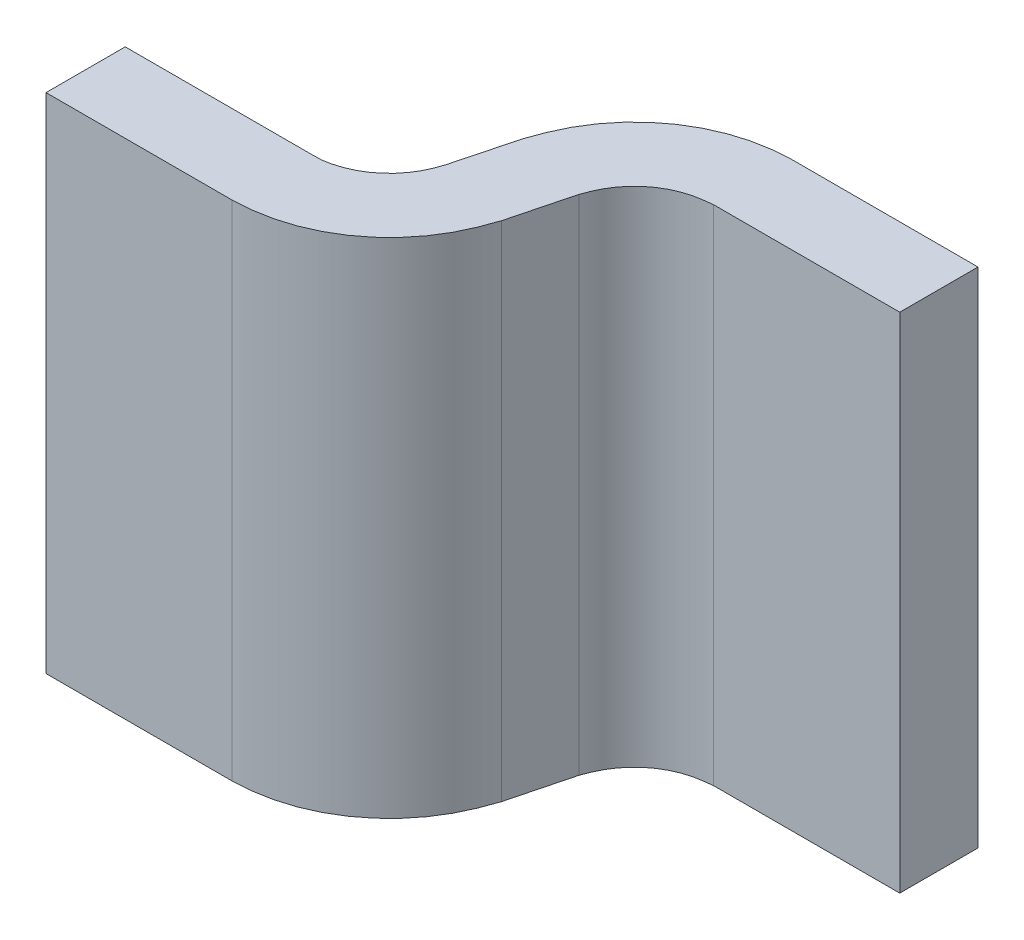
ISO-10303-21;
HEADER;
FILE_DESCRIPTION(('STEP AP214'),'2;1');
FILE_NAME('part.step','',(''),(''),'','','');
FILE_SCHEMA(('AUTOMOTIVE_DESIGN { 1 0 10303 214 1 1 1 1 }'));
ENDSEC;
DATA;
#1=APPLICATION_CONTEXT('core data for automotive mechanical design processes');
#2=APPLICATION_PROTOCOL_DEFINITION('international standard','automotive_design',2000,#1);
#3=PRODUCT_CONTEXT('',#1,'mechanical');
#4=PRODUCT('Part','Part','',(#3));
#5=PRODUCT_RELATED_PRODUCT_CATEGORY('part','',(#4));
#6=PRODUCT_DEFINITION_FORMATION('','',#4);
#7=PRODUCT_DEFINITION_CONTEXT('part definition',#1,'design');
#8=PRODUCT_DEFINITION('design','',#6,#7);
#9=PRODUCT_DEFINITION_SHAPE('','',#8);
#10=(LENGTH_UNIT() NAMED_UNIT(*) SI_UNIT(.MILLI.,.METRE.));
#11=(NAMED_UNIT(*) PLANE_ANGLE_UNIT() SI_UNIT($,.RADIAN.));
#12=(NAMED_UNIT(*) SI_UNIT($,.STERADIAN.) SOLID_ANGLE_UNIT());
#13=UNCERTAINTY_MEASURE_WITH_UNIT(LENGTH_MEASURE(1.E-05),#10,'distance_accuracy_value','');
#14=(GEOMETRIC_REPRESENTATION_CONTEXT(3) GLOBAL_UNCERTAINTY_ASSIGNED_CONTEXT((#13)) GLOBAL_UNIT_ASSIGNED_CONTEXT((#10,
#11,#12)) REPRESENTATION_CONTEXT('',''));
#15=CARTESIAN_POINT('',(0.,0.,0.));
#16=DIRECTION('',(0.,0.,1.));
#17=DIRECTION('',(1.,0.,0.));
#18=AXIS2_PLACEMENT_3D('',#15,#16,#17);
#19=CARTESIAN_POINT('',(0.876,1.204,0.238));
#20=DIRECTION('',(-1.,0.,0.));
#21=DIRECTION('',(0.,0.,1.));
#22=AXIS2_PLACEMENT_3D('',#19,#20,#21);
#23=PLANE('',#22);
#24=DIRECTION('',(0.,1.,0.));
#25=VECTOR('',#24,1.);
#26=CARTESIAN_POINT('',(0.876,0.696,0.238));
#27=LINE('',#26,#25);
#28=CARTESIAN_POINT('',(0.876,0.696,0.238));
#29=VERTEX_POINT('',#28);
#30=CARTESIAN_POINT('',(0.876,1.204,0.238));
#31=VERTEX_POINT('',#30);
#32=EDGE_CURVE('E11',#29,#31,#27,.T.);
#33=ORIENTED_EDGE('',*,*,#32,.F.);
#34=DIRECTION('',(0.,0.,-1.));
#35=VECTOR('',#34,1.);
#36=CARTESIAN_POINT('',(0.876,0.696,0.318));
#37=LINE('',#36,#35);
#38=CARTESIAN_POINT('',(0.876,0.696,0.318));
#39=VERTEX_POINT('',#38);
#40=EDGE_CURVE('E24',#39,#29,#37,.T.);
#41=ORIENTED_EDGE('',*,*,#40,.F.);
#42=DIRECTION('',(0.,-1.,0.));
#43=VECTOR('',#42,1.);
#44=CARTESIAN_POINT('',(0.876,1.204,0.318));
#45=LINE('',#44,#43);
#46=CARTESIAN_POINT('',(0.876,1.204,0.318));
#47=VERTEX_POINT('',#46);
#48=EDGE_CURVE('E439',#47,#39,#45,.T.);
#49=ORIENTED_EDGE('',*,*,#48,.F.);
#50=DIRECTION('',(0.,0.,1.));
#51=VECTOR('',#50,1.);
#52=CARTESIAN_POINT('',(0.876,1.204,0.238));
#53=LINE('',#52,#51);
#54=EDGE_CURVE('E437',#31,#47,#53,.T.);
#55=ORIENTED_EDGE('',*,*,#54,.F.);
#56=EDGE_LOOP('',(#33,#41,#49,#55));
#57=FACE_BOUND('',#56,.T.);
#58=ADVANCED_FACE('F17',(#57),#23,.T.);
#59=CARTESIAN_POINT('',(0.876,1.204,0.318));
#60=DIRECTION('',(0.,0.,1.));
#61=DIRECTION('',(0.,1.,0.));
#62=AXIS2_PLACEMENT_3D('',#59,#60,#61);
#63=PLANE('',#62);
#64=ORIENTED_EDGE('',*,*,#48,.T.);
#65=DIRECTION('',(-1.,0.,0.));
#66=VECTOR('',#65,1.);
#67=CARTESIAN_POINT('',(1.064,0.696,0.318));
#68=LINE('',#67,#66);
#69=CARTESIAN_POINT('',(1.064,0.696,0.318));
#70=VERTEX_POINT('',#69);
#71=EDGE_CURVE('E435',#70,#39,#68,.T.);
#72=ORIENTED_EDGE('',*,*,#71,.F.);
#73=CARTESIAN_POINT('',(1.064,1.204,0.31775));
#74=DIRECTION('',(0.,-1.,0.));
#75=VECTOR('',#74,1.);
#76=LINE('',#73,#75);
#77=CARTESIAN_POINT('',(1.064,1.204,0.318));
#78=VERTEX_POINT('',#77);
#79=EDGE_CURVE('E257',#78,#70,#76,.T.);
#80=ORIENTED_EDGE('',*,*,#79,.F.);
#81=DIRECTION('',(1.,0.,0.));
#82=VECTOR('',#81,1.);
#83=CARTESIAN_POINT('',(0.876,1.204,0.318));
#84=LINE('',#83,#82);
#85=EDGE_CURVE('E247',#47,#78,#84,.T.);
#86=ORIENTED_EDGE('',*,*,#85,.F.);
#87=EDGE_LOOP('',(#64,#72,#80,#86));
#88=FACE_BOUND('',#87,.T.);
#89=ADVANCED_FACE('F237',(#88),#63,.T.);
#90=CARTESIAN_POINT('',(0.876,0.696,0.238));
#91=DIRECTION('',(0.,0.,-1.));
#92=DIRECTION('',(0.,1.,0.));
#93=AXIS2_PLACEMENT_3D('',#90,#91,#92);
#94=PLANE('',#93);
#95=ORIENTED_EDGE('',*,*,#32,.T.);
#96=DIRECTION('',(-1.,0.,0.));
#97=VECTOR('',#96,1.);
#98=CARTESIAN_POINT('',(1.064,1.204,0.238));
#99=LINE('',#98,#97);
#100=CARTESIAN_POINT('',(1.064,1.204,0.238));
#101=VERTEX_POINT('',#100);
#102=EDGE_CURVE('E443',#101,#31,#99,.T.);
#103=ORIENTED_EDGE('',*,*,#102,.F.);
#104=CARTESIAN_POINT('',(1.064,0.696,0.238375));
#105=DIRECTION('',(0.,1.,0.));
#106=VECTOR('',#105,1.);
#107=LINE('',#104,#106);
#108=CARTESIAN_POINT('',(1.064,0.696,0.238));
#109=VERTEX_POINT('',#108);
#110=EDGE_CURVE('E222',#109,#101,#107,.T.);
#111=ORIENTED_EDGE('',*,*,#110,.F.);
#112=DIRECTION('',(1.,0.,0.));
#113=VECTOR('',#112,1.);
#114=CARTESIAN_POINT('',(0.876,0.696,0.238));
#115=LINE('',#114,#113);
#116=EDGE_CURVE('E219',#29,#109,#115,.T.);
#117=ORIENTED_EDGE('',*,*,#116,.F.);
#118=EDGE_LOOP('',(#95,#103,#111,#117));
#119=FACE_BOUND('',#118,.T.);
#120=ADVANCED_FACE('F228',(#119),#94,.T.);
#121=CARTESIAN_POINT('',(1.234,0.696,0.138));
#122=DIRECTION('',(0.965885549343203,0.,0.258969313954337));
#123=DIRECTION('',(-0.258969313954337,0.,0.965885549343203));
#124=AXIS2_PLACEMENT_3D('',#121,#122,#123);
#125=PLANE('',#124);
#126=CARTESIAN_POINT('',(1.23442187168926,1.204,0.138115055915251));
#127=DIRECTION('',(0.,-1.,0.));
#128=VECTOR('',#127,1.);
#129=LINE('',#126,#128);
#130=CARTESIAN_POINT('',(1.234,1.204,0.138));
#131=VERTEX_POINT('',#130);
#132=CARTESIAN_POINT('',(1.234,0.696,0.138));
#133=VERTEX_POINT('',#132);
#134=EDGE_CURVE('E215',#131,#133,#129,.T.);
#135=ORIENTED_EDGE('',*,*,#134,.F.);
#136=CARTESIAN_POINT('',(1.218,1.204,0.2));
#137=DIRECTION('',(0.258969313954338,0.,-0.965885549343202));
#138=VECTOR('',#137,1.);
#139=LINE('',#136,#138);
#140=CARTESIAN_POINT('',(1.218,1.204,0.2));
#141=VERTEX_POINT('',#140);
#142=EDGE_CURVE('E301',#141,#131,#139,.T.);
#143=ORIENTED_EDGE('',*,*,#142,.F.);
#144=CARTESIAN_POINT('',(1.21740631765688,0.696,0.199841941713844));
#145=DIRECTION('',(0.,1.,0.));
#146=VECTOR('',#145,1.);
#147=LINE('',#144,#146);
#148=CARTESIAN_POINT('',(1.218,0.696,0.2));
#149=VERTEX_POINT('',#148);
#150=EDGE_CURVE('E288',#149,#141,#147,.T.);
#151=ORIENTED_EDGE('',*,*,#150,.F.);
#152=DIRECTION('',(-0.258969313954337,0.,0.965885549343202));
#153=VECTOR('',#152,1.);
#154=CARTESIAN_POINT('',(1.234,0.696,0.138));
#155=LINE('',#154,#153);
#156=EDGE_CURVE('E356',#133,#149,#155,.T.);
#157=ORIENTED_EDGE('',*,*,#156,.F.);
#158=EDGE_LOOP('',(#135,#143,#151,#157));
#159=FACE_BOUND('',#158,.T.);
#160=ADVANCED_FACE('F236',(#159),#125,.T.);
#161=CARTESIAN_POINT('',(1.157,1.204,0.118));
#162=DIRECTION('',(-0.965885549343203,0.,-0.258969313954337));
#163=DIRECTION('',(-0.258969313954337,0.,0.965885549343203));
#164=AXIS2_PLACEMENT_3D('',#161,#162,#163);
#165=PLANE('',#164);
#166=CARTESIAN_POINT('',(1.15759368234312,0.696,0.118158058286156));
#167=DIRECTION('',(0.,1.,0.));
#168=VECTOR('',#167,1.);
#169=LINE('',#166,#168);
#170=CARTESIAN_POINT('',(1.157,0.696,0.118));
#171=VERTEX_POINT('',#170);
#172=CARTESIAN_POINT('',(1.157,1.204,0.118));
#173=VERTEX_POINT('',#172);
#174=EDGE_CURVE('E342',#171,#173,#169,.T.);
#175=ORIENTED_EDGE('',*,*,#174,.F.);
#176=CARTESIAN_POINT('',(1.141,0.696,0.179));
#177=DIRECTION('',(0.258969313954335,0.,-0.965885549343203));
#178=VECTOR('',#177,1.);
#179=LINE('',#176,#178);
#180=CARTESIAN_POINT('',(1.141,0.696,0.179));
#181=VERTEX_POINT('',#180);
#182=EDGE_CURVE('E330',#181,#171,#179,.T.);
#183=ORIENTED_EDGE('',*,*,#182,.F.);
#184=CARTESIAN_POINT('',(1.14082576891933,1.204,0.178954745173853));
#185=DIRECTION('',(0.,-1.,0.));
#186=VECTOR('',#185,1.);
#187=LINE('',#184,#186);
#188=CARTESIAN_POINT('',(1.141,1.204,0.179));
#189=VERTEX_POINT('',#188);
#190=EDGE_CURVE('E366',#189,#181,#187,.T.);
#191=ORIENTED_EDGE('',*,*,#190,.F.);
#192=DIRECTION('',(-0.258969313954337,0.,0.965885549343203));
#193=VECTOR('',#192,1.);
#194=CARTESIAN_POINT('',(1.157,1.204,0.118));
#195=LINE('',#194,#193);
#196=EDGE_CURVE('E368',#173,#189,#195,.T.);
#197=ORIENTED_EDGE('',*,*,#196,.F.);
#198=EDGE_LOOP('',(#175,#183,#191,#197));
#199=FACE_BOUND('',#198,.T.);
#200=ADVANCED_FACE('F160',(#199),#165,.T.);
#201=CARTESIAN_POINT('',(1.499,0.696,0.079));
#202=DIRECTION('',(0.,0.,1.));
#203=DIRECTION('',(0.,1.,0.));
#204=AXIS2_PLACEMENT_3D('',#201,#202,#203);
#205=PLANE('',#204);
#206=DIRECTION('',(0.,-1.,0.));
#207=VECTOR('',#206,1.);
#208=CARTESIAN_POINT('',(1.499,1.204,0.079));
#209=LINE('',#208,#207);
#210=CARTESIAN_POINT('',(1.499,1.204,0.079));
#211=VERTEX_POINT('',#210);
#212=CARTESIAN_POINT('',(1.499,0.696,0.079));
#213=VERTEX_POINT('',#212);
#214=EDGE_CURVE('E125',#211,#213,#209,.T.);
#215=ORIENTED_EDGE('',*,*,#214,.F.);
#216=DIRECTION('',(1.,0.,0.));
#217=VECTOR('',#216,1.);
#218=CARTESIAN_POINT('',(1.311,1.204,0.079));
#219=LINE('',#218,#217);
#220=CARTESIAN_POINT('',(1.311,1.204,0.079));
#221=VERTEX_POINT('',#220);
#222=EDGE_CURVE('E377',#221,#211,#219,.T.);
#223=ORIENTED_EDGE('',*,*,#222,.F.);
#224=CARTESIAN_POINT('',(1.311,0.696,0.079625));
#225=DIRECTION('',(0.,1.,0.));
#226=VECTOR('',#225,1.);
#227=LINE('',#224,#226);
#228=CARTESIAN_POINT('',(1.311,0.696,0.079));
#229=VERTEX_POINT('',#228);
#230=EDGE_CURVE('E178',#229,#221,#227,.T.);
#231=ORIENTED_EDGE('',*,*,#230,.F.);
#232=DIRECTION('',(-1.,0.,0.));
#233=VECTOR('',#232,1.);
#234=CARTESIAN_POINT('',(1.499,0.696,0.079));
#235=LINE('',#234,#233);
#236=EDGE_CURVE('E169',#213,#229,#235,.T.);
#237=ORIENTED_EDGE('',*,*,#236,.F.);
#238=EDGE_LOOP('',(#215,#223,#231,#237));
#239=FACE_BOUND('',#238,.T.);
#240=ADVANCED_FACE('F155',(#239),#205,.T.);
#241=CARTESIAN_POINT('',(1.311,0.696,0.));
#242=DIRECTION('',(0.,0.,-1.));
#243=DIRECTION('',(0.,1.,0.));
#244=AXIS2_PLACEMENT_3D('',#241,#242,#243);
#245=PLANE('',#244);
#246=CARTESIAN_POINT('',(1.311,1.204,0.000249999999999979));
#247=DIRECTION('',(0.,-1.,0.));
#248=VECTOR('',#247,1.);
#249=LINE('',#246,#248);
#250=CARTESIAN_POINT('',(1.311,1.204,0.));
#251=VERTEX_POINT('',#250);
#252=CARTESIAN_POINT('',(1.311,0.696,0.));
#253=VERTEX_POINT('',#252);
#254=EDGE_CURVE('E140',#251,#253,#249,.T.);
#255=ORIENTED_EDGE('',*,*,#254,.F.);
#256=DIRECTION('',(-1.,0.,0.));
#257=VECTOR('',#256,1.);
#258=CARTESIAN_POINT('',(1.499,1.204,0.));
#259=LINE('',#258,#257);
#260=CARTESIAN_POINT('',(1.499,1.204,0.));
#261=VERTEX_POINT('',#260);
#262=EDGE_CURVE('E107',#261,#251,#259,.T.);
#263=ORIENTED_EDGE('',*,*,#262,.F.);
#264=DIRECTION('',(0.,1.,0.));
#265=VECTOR('',#264,1.);
#266=CARTESIAN_POINT('',(1.499,0.696,0.));
#267=LINE('',#266,#265);
#268=CARTESIAN_POINT('',(1.499,0.696,0.));
#269=VERTEX_POINT('',#268);
#270=EDGE_CURVE('E101',#269,#261,#267,.T.);
#271=ORIENTED_EDGE('',*,*,#270,.F.);
#272=DIRECTION('',(1.,0.,0.));
#273=VECTOR('',#272,1.);
#274=CARTESIAN_POINT('',(1.311,0.696,0.));
#275=LINE('',#274,#273);
#276=EDGE_CURVE('E104',#253,#269,#275,.T.);
#277=ORIENTED_EDGE('',*,*,#276,.F.);
#278=EDGE_LOOP('',(#255,#263,#271,#277));
#279=FACE_BOUND('',#278,.T.);
#280=ADVANCED_FACE('F103',(#279),#245,.T.);
#281=CARTESIAN_POINT('',(1.499,0.696,0.));
#282=DIRECTION('',(1.,0.,0.));
#283=DIRECTION('',(0.,0.,1.));
#284=AXIS2_PLACEMENT_3D('',#281,#282,#283);
#285=PLANE('',#284);
#286=ORIENTED_EDGE('',*,*,#270,.T.);
#287=DIRECTION('',(0.,0.,-1.));
#288=VECTOR('',#287,1.);
#289=CARTESIAN_POINT('',(1.499,1.204,0.079));
#290=LINE('',#289,#288);
#291=EDGE_CURVE('E122',#211,#261,#290,.T.);
#292=ORIENTED_EDGE('',*,*,#291,.F.);
#293=ORIENTED_EDGE('',*,*,#214,.T.);
#294=DIRECTION('',(0.,0.,1.));
#295=VECTOR('',#294,1.);
#296=CARTESIAN_POINT('',(1.499,0.696,0.));
#297=LINE('',#296,#295);
#298=EDGE_CURVE('E118',#269,#213,#297,.T.);
#299=ORIENTED_EDGE('',*,*,#298,.F.);
#300=EDGE_LOOP('',(#286,#292,#293,#299));
#301=FACE_BOUND('',#300,.T.);
#302=ADVANCED_FACE('F124',(#301),#285,.T.);
#303=CARTESIAN_POINT('',(1.064,1.204,0.159));
#304=DIRECTION('',(0.,1.,0.));
#305=DIRECTION('',(0.,0.,1.));
#306=AXIS2_PLACEMENT_3D('',#303,#304,#305);
#307=CYLINDRICAL_SURFACE('',#306,0.15875);
#308=ORIENTED_EDGE('',*,*,#79,.T.);
#309=CARTESIAN_POINT('',(1.064,0.696,0.159));
#310=DIRECTION('',(0.,-1.,0.));
#311=DIRECTION('',(-0.793107076683516,0.,0.609082231652284));
#312=AXIS2_PLACEMENT_3D('',#309,#310,#311);
#313=CIRCLE('',#312,0.15875);
#314=EDGE_CURVE('E127',#149,#70,#313,.T.);
#315=ORIENTED_EDGE('',*,*,#314,.F.);
#316=ORIENTED_EDGE('',*,*,#150,.T.);
#317=CARTESIAN_POINT('',(1.064,1.204,0.159));
#318=DIRECTION('',(0.,1.,0.));
#319=DIRECTION('',(0.793107076683516,0.,-0.609082231652284));
#320=AXIS2_PLACEMENT_3D('',#317,#318,#319);
#321=CIRCLE('',#320,0.15875);
#322=EDGE_CURVE('E131',#78,#141,#321,.T.);
#323=ORIENTED_EDGE('',*,*,#322,.F.);
#324=EDGE_LOOP('',(#308,#315,#316,#323));
#325=FACE_BOUND('',#324,.T.);
#326=ADVANCED_FACE('F263',(#325),#307,.T.);
#327=CARTESIAN_POINT('',(1.064,0.696,0.159));
#328=DIRECTION('',(0.,1.,0.));
#329=DIRECTION('',(0.,0.,-1.));
#330=AXIS2_PLACEMENT_3D('',#327,#328,#329);
#331=CYLINDRICAL_SURFACE('',#330,0.079375);
#332=ORIENTED_EDGE('',*,*,#110,.T.);
#333=CARTESIAN_POINT('',(1.064,1.204,0.159));
#334=DIRECTION('',(0.,-1.,0.));
#335=DIRECTION('',(-0.793107076683516,0.,0.609082231652284));
#336=AXIS2_PLACEMENT_3D('',#333,#334,#335);
#337=CIRCLE('',#336,0.079375);
#338=EDGE_CURVE('E427',#189,#101,#337,.T.);
#339=ORIENTED_EDGE('',*,*,#338,.F.);
#340=ORIENTED_EDGE('',*,*,#190,.T.);
#341=CARTESIAN_POINT('',(1.064,0.696,0.159));
#342=DIRECTION('',(0.,1.,0.));
#343=DIRECTION('',(0.793107076683516,0.,-0.609082231652284));
#344=AXIS2_PLACEMENT_3D('',#341,#342,#343);
#345=CIRCLE('',#344,0.079375);
#346=EDGE_CURVE('E423',#109,#181,#345,.T.);
#347=ORIENTED_EDGE('',*,*,#346,.F.);
#348=EDGE_LOOP('',(#332,#339,#340,#347));
#349=FACE_BOUND('',#348,.T.);
#350=ADVANCED_FACE('F195',(#349),#331,.F.);
#351=CARTESIAN_POINT('',(1.311,0.696,0.159));
#352=DIRECTION('',(0.,1.,0.));
#353=DIRECTION('',(0.,0.,1.));
#354=AXIS2_PLACEMENT_3D('',#351,#352,#353);
#355=CYLINDRICAL_SURFACE('',#354,0.079375);
#356=ORIENTED_EDGE('',*,*,#230,.T.);
#357=CARTESIAN_POINT('',(1.311,1.204,0.159));
#358=DIRECTION('',(0.,-1.,0.));
#359=DIRECTION('',(0.793107076683516,0.,-0.609082231652284));
#360=AXIS2_PLACEMENT_3D('',#357,#358,#359);
#361=CIRCLE('',#360,0.079375);
#362=EDGE_CURVE('E418',#131,#221,#361,.T.);
#363=ORIENTED_EDGE('',*,*,#362,.F.);
#364=ORIENTED_EDGE('',*,*,#134,.T.);
#365=CARTESIAN_POINT('',(1.311,0.696,0.159));
#366=DIRECTION('',(0.,1.,0.));
#367=DIRECTION('',(-0.793107076683516,0.,0.609082231652284));
#368=AXIS2_PLACEMENT_3D('',#365,#366,#367);
#369=CIRCLE('',#368,0.079375);
#370=EDGE_CURVE('E408',#229,#133,#369,.T.);
#371=ORIENTED_EDGE('',*,*,#370,.F.);
#372=EDGE_LOOP('',(#356,#363,#364,#371));
#373=FACE_BOUND('',#372,.T.);
#374=ADVANCED_FACE('F184',(#373),#355,.F.);
#375=CARTESIAN_POINT('',(1.311,0.696,0.159));
#376=DIRECTION('',(0.,1.,0.));
#377=DIRECTION('',(0.,0.,-1.));
#378=AXIS2_PLACEMENT_3D('',#375,#376,#377);
#379=CYLINDRICAL_SURFACE('',#378,0.15875);
#380=ORIENTED_EDGE('',*,*,#254,.T.);
#381=CARTESIAN_POINT('',(1.311,0.696,0.159));
#382=DIRECTION('',(0.,-1.,0.));
#383=DIRECTION('',(0.793107076683516,0.,-0.609082231652284));
#384=AXIS2_PLACEMENT_3D('',#381,#382,#383);
#385=CIRCLE('',#384,0.15875);
#386=EDGE_CURVE('E121',#171,#253,#385,.T.);
#387=ORIENTED_EDGE('',*,*,#386,.F.);
#388=ORIENTED_EDGE('',*,*,#174,.T.);
#389=CARTESIAN_POINT('',(1.311,1.204,0.159));
#390=DIRECTION('',(0.,1.,0.));
#391=DIRECTION('',(-0.793107076683516,0.,0.609082231652284));
#392=AXIS2_PLACEMENT_3D('',#389,#390,#391);
#393=CIRCLE('',#392,0.15875);
#394=EDGE_CURVE('E405',#251,#173,#393,.T.);
#395=ORIENTED_EDGE('',*,*,#394,.F.);
#396=EDGE_LOOP('',(#380,#387,#388,#395));
#397=FACE_BOUND('',#396,.T.);
#398=ADVANCED_FACE('F194',(#397),#379,.T.);
#399=CARTESIAN_POINT('',(0.876,0.696,0.238));
#400=DIRECTION('',(0.,-1.,0.));
#401=DIRECTION('',(1.,0.,0.));
#402=AXIS2_PLACEMENT_3D('',#399,#400,#401);
#403=PLANE('',#402);
#404=ORIENTED_EDGE('',*,*,#71,.T.);
#405=ORIENTED_EDGE('',*,*,#40,.T.);
#406=ORIENTED_EDGE('',*,*,#116,.T.);
#407=ORIENTED_EDGE('',*,*,#346,.T.);
#408=ORIENTED_EDGE('',*,*,#182,.T.);
#409=ORIENTED_EDGE('',*,*,#386,.T.);
#410=ORIENTED_EDGE('',*,*,#276,.T.);
#411=ORIENTED_EDGE('',*,*,#298,.T.);
#412=ORIENTED_EDGE('',*,*,#236,.T.);
#413=ORIENTED_EDGE('',*,*,#370,.T.);
#414=ORIENTED_EDGE('',*,*,#156,.T.);
#415=ORIENTED_EDGE('',*,*,#314,.T.);
#416=EDGE_LOOP('',(#404,#405,#406,#407,#408,#409,#410,#411,#412,#413,#414,#415));
#417=FACE_BOUND('',#416,.T.);
#418=ADVANCED_FACE('F116',(#417),#403,.T.);
#419=CARTESIAN_POINT('',(1.311,1.204,0.079));
#420=DIRECTION('',(0.,1.,0.));
#421=DIRECTION('',(1.,0.,0.));
#422=AXIS2_PLACEMENT_3D('',#419,#420,#421);
#423=PLANE('',#422);
#424=ORIENTED_EDGE('',*,*,#102,.T.);
#425=ORIENTED_EDGE('',*,*,#54,.T.);
#426=ORIENTED_EDGE('',*,*,#85,.T.);
#427=ORIENTED_EDGE('',*,*,#322,.T.);
#428=ORIENTED_EDGE('',*,*,#142,.T.);
#429=ORIENTED_EDGE('',*,*,#362,.T.);
#430=ORIENTED_EDGE('',*,*,#222,.T.);
#431=ORIENTED_EDGE('',*,*,#291,.T.);
#432=ORIENTED_EDGE('',*,*,#262,.T.);
#433=ORIENTED_EDGE('',*,*,#394,.T.);
#434=ORIENTED_EDGE('',*,*,#196,.T.);
#435=ORIENTED_EDGE('',*,*,#338,.T.);
#436=EDGE_LOOP('',(#424,#425,#426,#427,#428,#429,#430,#431,#432,#433,#434,#435));
#437=FACE_BOUND('',#436,.T.);
#438=ADVANCED_FACE('F306',(#437),#423,.T.);
#439=CLOSED_SHELL('',(#58,#89,#120,#160,#200,#240,#280,#302,#326,#350,#374,#398,#418,#438));
#440=MANIFOLD_SOLID_BREP('B1',#439);
#441=ADVANCED_BREP_SHAPE_REPRESENTATION('',(#18,#440),#14);
#442=SHAPE_DEFINITION_REPRESENTATION(#9,#441);
ENDSEC;
END-ISO-10303-21;
